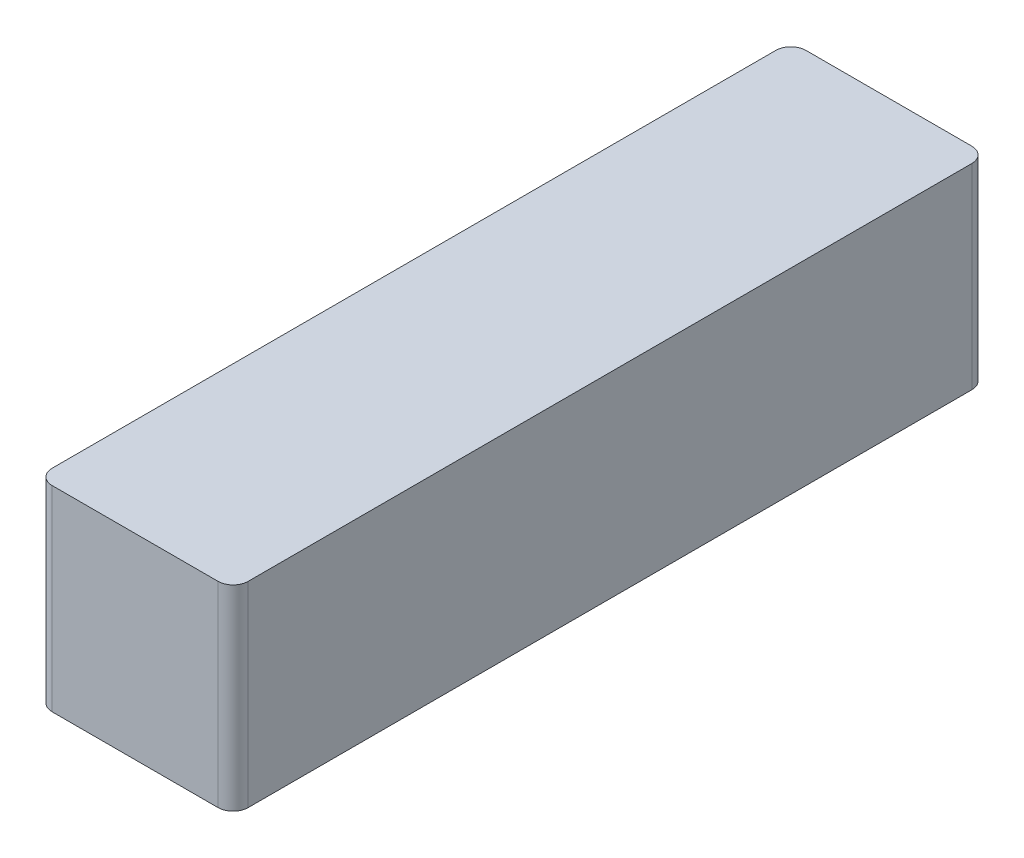
ISO-10303-21;
HEADER;
FILE_DESCRIPTION(('STEP AP214'),'2;1');
FILE_NAME('part.step','',(''),(''),'','','');
FILE_SCHEMA(('AUTOMOTIVE_DESIGN { 1 0 10303 214 1 1 1 1 }'));
ENDSEC;
DATA;
#1=APPLICATION_CONTEXT('core data for automotive mechanical design processes');
#2=APPLICATION_PROTOCOL_DEFINITION('international standard','automotive_design',2000,#1);
#3=PRODUCT_CONTEXT('',#1,'mechanical');
#4=PRODUCT('Part','Part','',(#3));
#5=PRODUCT_RELATED_PRODUCT_CATEGORY('part','',(#4));
#6=PRODUCT_DEFINITION_FORMATION('','',#4);
#7=PRODUCT_DEFINITION_CONTEXT('part definition',#1,'design');
#8=PRODUCT_DEFINITION('design','',#6,#7);
#9=PRODUCT_DEFINITION_SHAPE('','',#8);
#10=(LENGTH_UNIT() NAMED_UNIT(*) SI_UNIT(.MILLI.,.METRE.));
#11=(NAMED_UNIT(*) PLANE_ANGLE_UNIT() SI_UNIT($,.RADIAN.));
#12=(NAMED_UNIT(*) SI_UNIT($,.STERADIAN.) SOLID_ANGLE_UNIT());
#13=UNCERTAINTY_MEASURE_WITH_UNIT(LENGTH_MEASURE(1.E-05),#10,'distance_accuracy_value','');
#14=(GEOMETRIC_REPRESENTATION_CONTEXT(3) GLOBAL_UNCERTAINTY_ASSIGNED_CONTEXT((#13)) GLOBAL_UNIT_ASSIGNED_CONTEXT((#10,
#11,#12)) REPRESENTATION_CONTEXT('',''));
#15=CARTESIAN_POINT('',(0.,0.,0.));
#16=DIRECTION('',(0.,0.,1.));
#17=DIRECTION('',(1.,0.,0.));
#18=AXIS2_PLACEMENT_3D('',#15,#16,#17);
#19=CARTESIAN_POINT('',(1.651,1.651,12.7));
#20=DIRECTION('',(-1.,0.,0.));
#21=DIRECTION('',(0.,-1.,0.));
#22=AXIS2_PLACEMENT_3D('',#19,#20,#21);
#23=PLANE('',#22);
#24=DIRECTION('',(0.,0.,-1.));
#25=VECTOR('',#24,1.);
#26=CARTESIAN_POINT('',(1.651,-1.651,12.7));
#27=LINE('',#26,#25);
#28=CARTESIAN_POINT('',(1.651,-1.651,12.446));
#29=VERTEX_POINT('',#28);
#30=CARTESIAN_POINT('',(1.651,-1.651,0.254000000000001));
#31=VERTEX_POINT('',#30);
#32=EDGE_CURVE('E120',#29,#31,#27,.T.);
#33=ORIENTED_EDGE('',*,*,#32,.T.);
#34=DIRECTION('',(0.,1.,0.));
#35=VECTOR('',#34,1.);
#36=CARTESIAN_POINT('',(1.651,1.651,0.254000000000001));
#37=LINE('',#36,#35);
#38=CARTESIAN_POINT('',(1.651,1.651,0.254000000000001));
#39=VERTEX_POINT('',#38);
#40=EDGE_CURVE('E146',#31,#39,#37,.T.);
#41=ORIENTED_EDGE('',*,*,#40,.T.);
#42=DIRECTION('',(0.,0.,-1.));
#43=VECTOR('',#42,1.);
#44=CARTESIAN_POINT('',(1.651,1.651,12.7));
#45=LINE('',#44,#43);
#46=CARTESIAN_POINT('',(1.651,1.651,12.446));
#47=VERTEX_POINT('',#46);
#48=EDGE_CURVE('E125',#47,#39,#45,.T.);
#49=ORIENTED_EDGE('',*,*,#48,.F.);
#50=DIRECTION('',(0.,1.,0.));
#51=VECTOR('',#50,1.);
#52=CARTESIAN_POINT('',(1.651,-1.651,12.446));
#53=LINE('',#52,#51);
#54=EDGE_CURVE('E144',#47,#29,#53,.F.);
#55=ORIENTED_EDGE('',*,*,#54,.T.);
#56=EDGE_LOOP('',(#33,#41,#49,#55));
#57=FACE_BOUND('',#56,.T.);
#58=ADVANCED_FACE('F32',(#57),#23,.F.);
#59=CARTESIAN_POINT('',(-1.651,1.651,12.7));
#60=DIRECTION('',(0.,-1.,0.));
#61=DIRECTION('',(0.,0.,-1.));
#62=AXIS2_PLACEMENT_3D('',#59,#60,#61);
#63=PLANE('',#62);
#64=DIRECTION('',(-1.,0.,0.));
#65=VECTOR('',#64,1.);
#66=CARTESIAN_POINT('',(-1.651,1.651,0.));
#67=LINE('',#66,#65);
#68=CARTESIAN_POINT('',(1.397,1.651,0.));
#69=VERTEX_POINT('',#68);
#70=CARTESIAN_POINT('',(-1.397,1.651,0.));
#71=VERTEX_POINT('',#70);
#72=EDGE_CURVE('E161',#69,#71,#67,.T.);
#73=ORIENTED_EDGE('',*,*,#72,.T.);
#74=CARTESIAN_POINT('',(-1.397,1.651,0.254000000000001));
#75=DIRECTION('',(0.,-1.,0.));
#76=DIRECTION('',(0.,0.,-1.));
#77=AXIS2_PLACEMENT_3D('',#74,#75,#76);
#78=CIRCLE('',#77,0.254);
#79=CARTESIAN_POINT('',(-1.651,1.651,0.254000000000001));
#80=VERTEX_POINT('',#79);
#81=EDGE_CURVE('E142',#71,#80,#78,.F.);
#82=ORIENTED_EDGE('',*,*,#81,.T.);
#83=DIRECTION('',(0.,0.,-1.));
#84=VECTOR('',#83,1.);
#85=CARTESIAN_POINT('',(-1.651,1.651,12.7));
#86=LINE('',#85,#84);
#87=CARTESIAN_POINT('',(-1.651,1.651,12.446));
#88=VERTEX_POINT('',#87);
#89=EDGE_CURVE('E119',#88,#80,#86,.T.);
#90=ORIENTED_EDGE('',*,*,#89,.F.);
#91=CARTESIAN_POINT('',(-1.397,1.651,12.446));
#92=DIRECTION('',(0.,-1.,0.));
#93=DIRECTION('',(0.,0.,-1.));
#94=AXIS2_PLACEMENT_3D('',#91,#92,#93);
#95=CIRCLE('',#94,0.254);
#96=CARTESIAN_POINT('',(-1.397,1.651,12.7));
#97=VERTEX_POINT('',#96);
#98=EDGE_CURVE('E124',#88,#97,#95,.F.);
#99=ORIENTED_EDGE('',*,*,#98,.T.);
#100=DIRECTION('',(-1.,0.,0.));
#101=VECTOR('',#100,1.);
#102=CARTESIAN_POINT('',(-1.651,1.651,12.7));
#103=LINE('',#102,#101);
#104=CARTESIAN_POINT('',(1.397,1.651,12.7));
#105=VERTEX_POINT('',#104);
#106=EDGE_CURVE('E152',#105,#97,#103,.T.);
#107=ORIENTED_EDGE('',*,*,#106,.F.);
#108=CARTESIAN_POINT('',(1.397,1.651,12.446));
#109=DIRECTION('',(0.,-1.,0.));
#110=DIRECTION('',(0.,0.,-1.));
#111=AXIS2_PLACEMENT_3D('',#108,#109,#110);
#112=CIRCLE('',#111,0.254);
#113=EDGE_CURVE('E55',#105,#47,#112,.F.);
#114=ORIENTED_EDGE('',*,*,#113,.T.);
#115=ORIENTED_EDGE('',*,*,#48,.T.);
#116=CARTESIAN_POINT('',(1.397,1.651,0.254000000000001));
#117=DIRECTION('',(0.,-1.,0.));
#118=DIRECTION('',(0.,0.,-1.));
#119=AXIS2_PLACEMENT_3D('',#116,#117,#118);
#120=CIRCLE('',#119,0.254);
#121=EDGE_CURVE('E47',#39,#69,#120,.F.);
#122=ORIENTED_EDGE('',*,*,#121,.T.);
#123=EDGE_LOOP('',(#73,#82,#90,#99,#107,#114,#115,#122));
#124=FACE_BOUND('',#123,.T.);
#125=ADVANCED_FACE('F156',(#124),#63,.F.);
#126=CARTESIAN_POINT('',(-1.651,1.651,12.7));
#127=DIRECTION('',(1.,0.,0.));
#128=DIRECTION('',(0.,1.,0.));
#129=AXIS2_PLACEMENT_3D('',#126,#127,#128);
#130=PLANE('',#129);
#131=ORIENTED_EDGE('',*,*,#89,.T.);
#132=DIRECTION('',(0.,-1.,0.));
#133=VECTOR('',#132,1.);
#134=CARTESIAN_POINT('',(-1.651,1.651,0.254000000000001));
#135=LINE('',#134,#133);
#136=CARTESIAN_POINT('',(-1.651,-1.651,0.254000000000001));
#137=VERTEX_POINT('',#136);
#138=EDGE_CURVE('E118',#80,#137,#135,.T.);
#139=ORIENTED_EDGE('',*,*,#138,.T.);
#140=DIRECTION('',(0.,0.,-1.));
#141=VECTOR('',#140,1.);
#142=CARTESIAN_POINT('',(-1.651,-1.651,12.7));
#143=LINE('',#142,#141);
#144=CARTESIAN_POINT('',(-1.651,-1.651,12.446));
#145=VERTEX_POINT('',#144);
#146=EDGE_CURVE('E102',#145,#137,#143,.T.);
#147=ORIENTED_EDGE('',*,*,#146,.F.);
#148=DIRECTION('',(0.,-1.,0.));
#149=VECTOR('',#148,1.);
#150=CARTESIAN_POINT('',(-1.651,1.651,12.446));
#151=LINE('',#150,#149);
#152=EDGE_CURVE('E115',#145,#88,#151,.F.);
#153=ORIENTED_EDGE('',*,*,#152,.T.);
#154=EDGE_LOOP('',(#131,#139,#147,#153));
#155=FACE_BOUND('',#154,.T.);
#156=ADVANCED_FACE('F114',(#155),#130,.F.);
#157=CARTESIAN_POINT('',(-1.651,-1.651,12.7));
#158=DIRECTION('',(0.,1.,0.));
#159=DIRECTION('',(0.,0.,1.));
#160=AXIS2_PLACEMENT_3D('',#157,#158,#159);
#161=PLANE('',#160);
#162=ORIENTED_EDGE('',*,*,#146,.T.);
#163=CARTESIAN_POINT('',(-1.397,-1.651,0.254000000000001));
#164=DIRECTION('',(0.,1.,0.));
#165=DIRECTION('',(0.,0.,1.));
#166=AXIS2_PLACEMENT_3D('',#163,#164,#165);
#167=CIRCLE('',#166,0.254);
#168=CARTESIAN_POINT('',(-1.397,-1.651,0.));
#169=VERTEX_POINT('',#168);
#170=EDGE_CURVE('E133',#137,#169,#167,.F.);
#171=ORIENTED_EDGE('',*,*,#170,.T.);
#172=DIRECTION('',(1.,0.,0.));
#173=VECTOR('',#172,1.);
#174=CARTESIAN_POINT('',(-1.651,-1.651,0.));
#175=LINE('',#174,#173);
#176=CARTESIAN_POINT('',(1.397,-1.651,0.));
#177=VERTEX_POINT('',#176);
#178=EDGE_CURVE('E157',#169,#177,#175,.T.);
#179=ORIENTED_EDGE('',*,*,#178,.T.);
#180=CARTESIAN_POINT('',(1.397,-1.651,0.254000000000001));
#181=DIRECTION('',(0.,1.,0.));
#182=DIRECTION('',(0.,0.,1.));
#183=AXIS2_PLACEMENT_3D('',#180,#181,#182);
#184=CIRCLE('',#183,0.254);
#185=EDGE_CURVE('E108',#177,#31,#184,.F.);
#186=ORIENTED_EDGE('',*,*,#185,.T.);
#187=ORIENTED_EDGE('',*,*,#32,.F.);
#188=CARTESIAN_POINT('',(1.397,-1.651,12.446));
#189=DIRECTION('',(0.,1.,0.));
#190=DIRECTION('',(0.,0.,1.));
#191=AXIS2_PLACEMENT_3D('',#188,#189,#190);
#192=CIRCLE('',#191,0.254);
#193=CARTESIAN_POINT('',(1.397,-1.651,12.7));
#194=VERTEX_POINT('',#193);
#195=EDGE_CURVE('E109',#29,#194,#192,.F.);
#196=ORIENTED_EDGE('',*,*,#195,.T.);
#197=DIRECTION('',(1.,0.,0.));
#198=VECTOR('',#197,1.);
#199=CARTESIAN_POINT('',(-1.651,-1.651,12.7));
#200=LINE('',#199,#198);
#201=CARTESIAN_POINT('',(-1.397,-1.651,12.7));
#202=VERTEX_POINT('',#201);
#203=EDGE_CURVE('E104',#202,#194,#200,.T.);
#204=ORIENTED_EDGE('',*,*,#203,.F.);
#205=CARTESIAN_POINT('',(-1.397,-1.651,12.446));
#206=DIRECTION('',(0.,1.,0.));
#207=DIRECTION('',(0.,0.,1.));
#208=AXIS2_PLACEMENT_3D('',#205,#206,#207);
#209=CIRCLE('',#208,0.254);
#210=EDGE_CURVE('E99',#202,#145,#209,.F.);
#211=ORIENTED_EDGE('',*,*,#210,.T.);
#212=EDGE_LOOP('',(#162,#171,#179,#186,#187,#196,#204,#211));
#213=FACE_BOUND('',#212,.T.);
#214=ADVANCED_FACE('F101',(#213),#161,.F.);
#215=CARTESIAN_POINT('',(0.,0.,12.7));
#216=DIRECTION('',(0.,0.,1.));
#217=DIRECTION('',(1.,0.,0.));
#218=AXIS2_PLACEMENT_3D('',#215,#216,#217);
#219=PLANE('',#218);
#220=ORIENTED_EDGE('',*,*,#106,.T.);
#221=DIRECTION('',(0.,-1.,0.));
#222=VECTOR('',#221,1.);
#223=CARTESIAN_POINT('',(-1.397,-1.651,12.7));
#224=LINE('',#223,#222);
#225=EDGE_CURVE('E11',#97,#202,#224,.T.);
#226=ORIENTED_EDGE('',*,*,#225,.T.);
#227=ORIENTED_EDGE('',*,*,#203,.T.);
#228=DIRECTION('',(0.,1.,0.));
#229=VECTOR('',#228,1.);
#230=CARTESIAN_POINT('',(1.397,1.651,12.7));
#231=LINE('',#230,#229);
#232=EDGE_CURVE('E40',#194,#105,#231,.T.);
#233=ORIENTED_EDGE('',*,*,#232,.T.);
#234=EDGE_LOOP('',(#220,#226,#227,#233));
#235=FACE_BOUND('',#234,.T.);
#236=ADVANCED_FACE('F151',(#235),#219,.T.);
#237=CARTESIAN_POINT('',(0.,0.,0.));
#238=DIRECTION('',(0.,0.,1.));
#239=DIRECTION('',(1.,0.,0.));
#240=AXIS2_PLACEMENT_3D('',#237,#238,#239);
#241=PLANE('',#240);
#242=ORIENTED_EDGE('',*,*,#178,.F.);
#243=DIRECTION('',(0.,-1.,0.));
#244=VECTOR('',#243,1.);
#245=CARTESIAN_POINT('',(-1.397,0.,0.));
#246=LINE('',#245,#244);
#247=EDGE_CURVE('E137',#169,#71,#246,.F.);
#248=ORIENTED_EDGE('',*,*,#247,.T.);
#249=ORIENTED_EDGE('',*,*,#72,.F.);
#250=DIRECTION('',(0.,1.,0.));
#251=VECTOR('',#250,1.);
#252=CARTESIAN_POINT('',(1.397,0.,0.));
#253=LINE('',#252,#251);
#254=EDGE_CURVE('E135',#69,#177,#253,.F.);
#255=ORIENTED_EDGE('',*,*,#254,.T.);
#256=EDGE_LOOP('',(#242,#248,#249,#255));
#257=FACE_BOUND('',#256,.T.);
#258=ADVANCED_FACE('F173',(#257),#241,.F.);
#259=CARTESIAN_POINT('',(-1.397,1.651,0.254000000000001));
#260=DIRECTION('',(0.,-1.,0.));
#261=DIRECTION('',(1.,0.,0.));
#262=AXIS2_PLACEMENT_3D('',#259,#260,#261);
#263=CYLINDRICAL_SURFACE('',#262,0.254);
#264=ORIENTED_EDGE('',*,*,#81,.F.);
#265=ORIENTED_EDGE('',*,*,#247,.F.);
#266=ORIENTED_EDGE('',*,*,#170,.F.);
#267=ORIENTED_EDGE('',*,*,#138,.F.);
#268=EDGE_LOOP('',(#264,#265,#266,#267));
#269=FACE_BOUND('',#268,.T.);
#270=ADVANCED_FACE('F168',(#269),#263,.T.);
#271=CARTESIAN_POINT('',(1.397,1.651,0.254000000000001));
#272=DIRECTION('',(0.,1.,0.));
#273=DIRECTION('',(-1.,0.,0.));
#274=AXIS2_PLACEMENT_3D('',#271,#272,#273);
#275=CYLINDRICAL_SURFACE('',#274,0.254);
#276=ORIENTED_EDGE('',*,*,#185,.F.);
#277=ORIENTED_EDGE('',*,*,#254,.F.);
#278=ORIENTED_EDGE('',*,*,#121,.F.);
#279=ORIENTED_EDGE('',*,*,#40,.F.);
#280=EDGE_LOOP('',(#276,#277,#278,#279));
#281=FACE_BOUND('',#280,.T.);
#282=ADVANCED_FACE('F175',(#281),#275,.T.);
#283=CARTESIAN_POINT('',(-1.397,0.,12.446));
#284=DIRECTION('',(0.,1.,0.));
#285=DIRECTION('',(-1.,0.,0.));
#286=AXIS2_PLACEMENT_3D('',#283,#284,#285);
#287=CYLINDRICAL_SURFACE('',#286,0.254);
#288=ORIENTED_EDGE('',*,*,#98,.F.);
#289=ORIENTED_EDGE('',*,*,#152,.F.);
#290=ORIENTED_EDGE('',*,*,#210,.F.);
#291=ORIENTED_EDGE('',*,*,#225,.F.);
#292=EDGE_LOOP('',(#288,#289,#290,#291));
#293=FACE_BOUND('',#292,.T.);
#294=ADVANCED_FACE('F123',(#293),#287,.T.);
#295=CARTESIAN_POINT('',(1.397,0.,12.446));
#296=DIRECTION('',(0.,-1.,0.));
#297=DIRECTION('',(1.,0.,0.));
#298=AXIS2_PLACEMENT_3D('',#295,#296,#297);
#299=CYLINDRICAL_SURFACE('',#298,0.254);
#300=ORIENTED_EDGE('',*,*,#195,.F.);
#301=ORIENTED_EDGE('',*,*,#54,.F.);
#302=ORIENTED_EDGE('',*,*,#113,.F.);
#303=ORIENTED_EDGE('',*,*,#232,.F.);
#304=EDGE_LOOP('',(#300,#301,#302,#303));
#305=FACE_BOUND('',#304,.T.);
#306=ADVANCED_FACE('F34',(#305),#299,.T.);
#307=CLOSED_SHELL('',(#58,#125,#156,#214,#236,#258,#270,#282,#294,#306));
#308=MANIFOLD_SOLID_BREP('B2',#307);
#309=ADVANCED_BREP_SHAPE_REPRESENTATION('',(#18,#308),#14);
#310=SHAPE_DEFINITION_REPRESENTATION(#9,#309);
ENDSEC;
END-ISO-10303-21;
